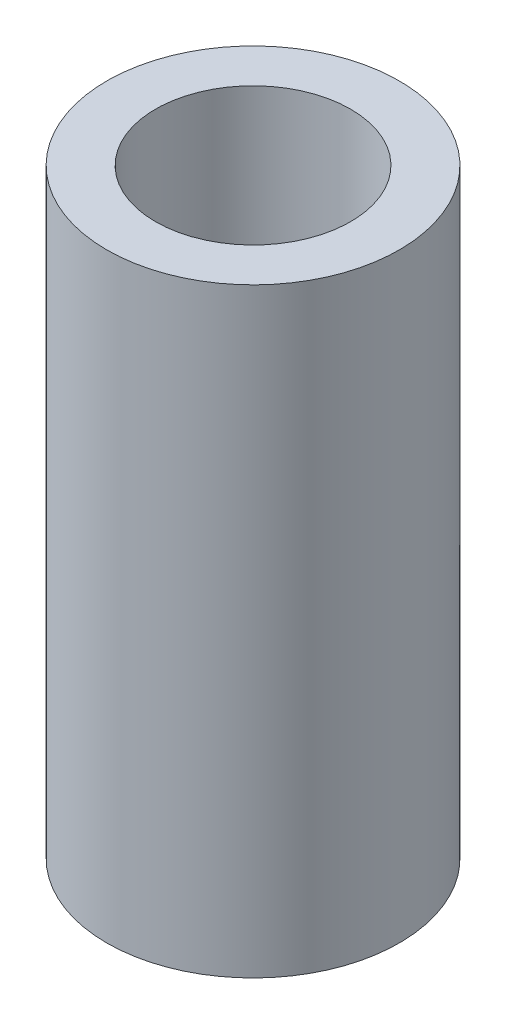
ISO-10303-21;
HEADER;
FILE_DESCRIPTION(('STEP AP214'),'2;1');
FILE_NAME('part.step','',(''),(''),'','','');
FILE_SCHEMA(('AUTOMOTIVE_DESIGN { 1 0 10303 214 1 1 1 1 }'));
ENDSEC;
DATA;
#1=APPLICATION_CONTEXT('core data for automotive mechanical design processes');
#2=APPLICATION_PROTOCOL_DEFINITION('international standard','automotive_design',2000,#1);
#3=PRODUCT_CONTEXT('',#1,'mechanical');
#4=PRODUCT('Part','Part','',(#3));
#5=PRODUCT_RELATED_PRODUCT_CATEGORY('part','',(#4));
#6=PRODUCT_DEFINITION_FORMATION('','',#4);
#7=PRODUCT_DEFINITION_CONTEXT('part definition',#1,'design');
#8=PRODUCT_DEFINITION('design','',#6,#7);
#9=PRODUCT_DEFINITION_SHAPE('','',#8);
#10=(LENGTH_UNIT() NAMED_UNIT(*) SI_UNIT(.MILLI.,.METRE.));
#11=(NAMED_UNIT(*) PLANE_ANGLE_UNIT() SI_UNIT($,.RADIAN.));
#12=(NAMED_UNIT(*) SI_UNIT($,.STERADIAN.) SOLID_ANGLE_UNIT());
#13=UNCERTAINTY_MEASURE_WITH_UNIT(LENGTH_MEASURE(1.E-05),#10,'distance_accuracy_value','');
#14=(GEOMETRIC_REPRESENTATION_CONTEXT(3) GLOBAL_UNCERTAINTY_ASSIGNED_CONTEXT((#13)) GLOBAL_UNIT_ASSIGNED_CONTEXT((#10,
#11,#12)) REPRESENTATION_CONTEXT('',''));
#15=CARTESIAN_POINT('',(0.,0.,0.));
#16=DIRECTION('',(0.,0.,1.));
#17=DIRECTION('',(1.,0.,0.));
#18=AXIS2_PLACEMENT_3D('',#15,#16,#17);
#19=CARTESIAN_POINT('',(0.,8.,0.));
#20=DIRECTION('',(0.,1.,0.));
#21=DIRECTION('',(0.,0.,1.));
#22=AXIS2_PLACEMENT_3D('',#19,#20,#21);
#23=PLANE('',#22);
#24=CARTESIAN_POINT('',(0.,8.,0.));
#25=DIRECTION('',(0.,1.,0.));
#26=DIRECTION('',(0.,0.,1.));
#27=AXIS2_PLACEMENT_3D('',#24,#25,#26);
#28=CIRCLE('',#27,1.95);
#29=CARTESIAN_POINT('',(0.,8.,1.95));
#30=VERTEX_POINT('',#29);
#31=EDGE_CURVE('E10',#30,#30,#28,.T.);
#32=ORIENTED_EDGE('',*,*,#31,.T.);
#33=EDGE_LOOP('',(#32));
#34=FACE_BOUND('',#33,.T.);
#35=CARTESIAN_POINT('',(0.,8.,0.));
#36=DIRECTION('',(0.,1.,0.));
#37=DIRECTION('',(0.,0.,1.));
#38=AXIS2_PLACEMENT_3D('',#35,#36,#37);
#39=CIRCLE('',#38,1.3);
#40=CARTESIAN_POINT('',(0.,8.,1.3));
#41=VERTEX_POINT('',#40);
#42=EDGE_CURVE('E50',#41,#41,#39,.T.);
#43=ORIENTED_EDGE('',*,*,#42,.F.);
#44=EDGE_LOOP('',(#43));
#45=FACE_BOUND('',#44,.T.);
#46=ADVANCED_FACE('F37',(#34,#45),#23,.T.);
#47=CARTESIAN_POINT('',(0.,0.,0.));
#48=DIRECTION('',(0.,1.,0.));
#49=DIRECTION('',(0.,0.,1.));
#50=AXIS2_PLACEMENT_3D('',#47,#48,#49);
#51=PLANE('',#50);
#52=CARTESIAN_POINT('',(0.,0.,0.));
#53=DIRECTION('',(0.,1.,0.));
#54=DIRECTION('',(0.,0.,1.));
#55=AXIS2_PLACEMENT_3D('',#52,#53,#54);
#56=CIRCLE('',#55,1.95);
#57=CARTESIAN_POINT('',(0.,0.,1.95));
#58=VERTEX_POINT('',#57);
#59=EDGE_CURVE('E41',#58,#58,#56,.T.);
#60=ORIENTED_EDGE('',*,*,#59,.F.);
#61=EDGE_LOOP('',(#60));
#62=FACE_BOUND('',#61,.T.);
#63=CARTESIAN_POINT('',(0.,0.,0.));
#64=DIRECTION('',(0.,1.,0.));
#65=DIRECTION('',(0.,0.,1.));
#66=AXIS2_PLACEMENT_3D('',#63,#64,#65);
#67=CIRCLE('',#66,1.3);
#68=CARTESIAN_POINT('',(0.,0.,1.3));
#69=VERTEX_POINT('',#68);
#70=EDGE_CURVE('E52',#69,#69,#67,.T.);
#71=ORIENTED_EDGE('',*,*,#70,.T.);
#72=EDGE_LOOP('',(#71));
#73=FACE_BOUND('',#72,.T.);
#74=ADVANCED_FACE('F64',(#62,#73),#51,.F.);
#75=CARTESIAN_POINT('',(0.,8.,0.));
#76=DIRECTION('',(0.,-1.,0.));
#77=DIRECTION('',(0.,0.,-1.));
#78=AXIS2_PLACEMENT_3D('',#75,#76,#77);
#79=CYLINDRICAL_SURFACE('',#78,1.95);
#80=ORIENTED_EDGE('',*,*,#31,.F.);
#81=EDGE_LOOP('',(#80));
#82=FACE_BOUND('',#81,.T.);
#83=ORIENTED_EDGE('',*,*,#59,.T.);
#84=EDGE_LOOP('',(#83));
#85=FACE_BOUND('',#84,.T.);
#86=ADVANCED_FACE('F39',(#82,#85),#79,.T.);
#87=CARTESIAN_POINT('',(0.,8.,0.));
#88=DIRECTION('',(0.,-1.,0.));
#89=DIRECTION('',(0.,0.,-1.));
#90=AXIS2_PLACEMENT_3D('',#87,#88,#89);
#91=CYLINDRICAL_SURFACE('',#90,1.3);
#92=ORIENTED_EDGE('',*,*,#42,.T.);
#93=EDGE_LOOP('',(#92));
#94=FACE_BOUND('',#93,.T.);
#95=ORIENTED_EDGE('',*,*,#70,.F.);
#96=EDGE_LOOP('',(#95));
#97=FACE_BOUND('',#96,.T.);
#98=ADVANCED_FACE('F60',(#94,#97),#91,.F.);
#99=CLOSED_SHELL('',(#46,#74,#86,#98));
#100=MANIFOLD_SOLID_BREP('B2',#99);
#101=ADVANCED_BREP_SHAPE_REPRESENTATION('',(#18,#100),#14);
#102=SHAPE_DEFINITION_REPRESENTATION(#9,#101);
ENDSEC;
END-ISO-10303-21;
